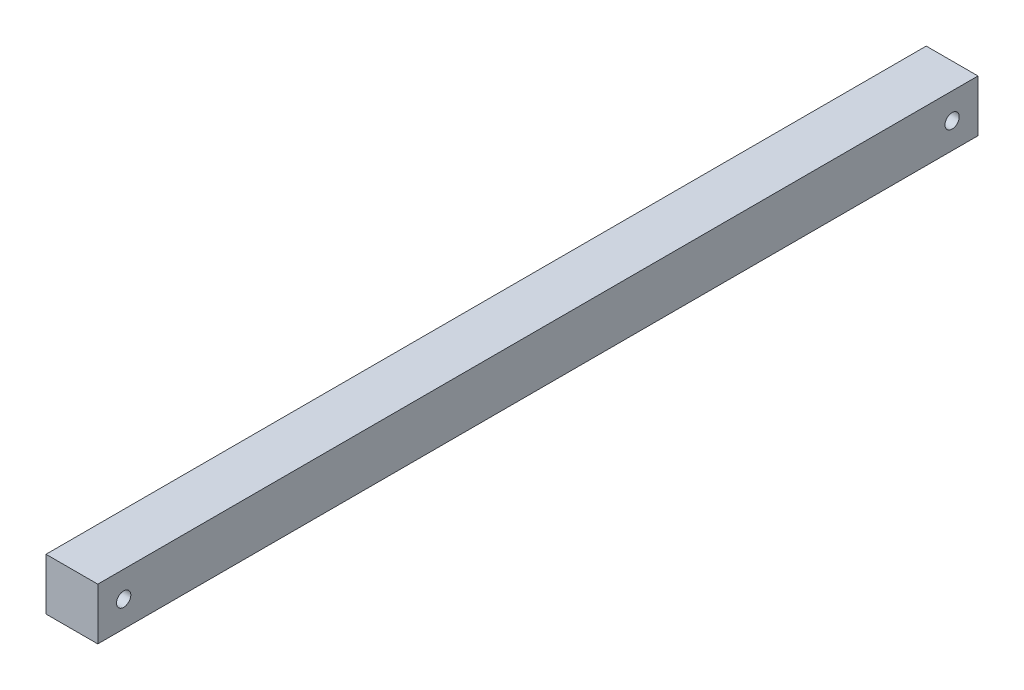
ISO-10303-21;
HEADER;
FILE_DESCRIPTION(('STEP AP214'),'2;1');
FILE_NAME('part.step','',(''),(''),'','','');
FILE_SCHEMA(('AUTOMOTIVE_DESIGN { 1 0 10303 214 1 1 1 1 }'));
ENDSEC;
DATA;
#1=APPLICATION_CONTEXT('core data for automotive mechanical design processes');
#2=APPLICATION_PROTOCOL_DEFINITION('international standard','automotive_design',2000,#1);
#3=PRODUCT_CONTEXT('',#1,'mechanical');
#4=PRODUCT('Part','Part','',(#3));
#5=PRODUCT_RELATED_PRODUCT_CATEGORY('part','',(#4));
#6=PRODUCT_DEFINITION_FORMATION('','',#4);
#7=PRODUCT_DEFINITION_CONTEXT('part definition',#1,'design');
#8=PRODUCT_DEFINITION('design','',#6,#7);
#9=PRODUCT_DEFINITION_SHAPE('','',#8);
#10=(LENGTH_UNIT() NAMED_UNIT(*) SI_UNIT(.MILLI.,.METRE.));
#11=(NAMED_UNIT(*) PLANE_ANGLE_UNIT() SI_UNIT($,.RADIAN.));
#12=(NAMED_UNIT(*) SI_UNIT($,.STERADIAN.) SOLID_ANGLE_UNIT());
#13=UNCERTAINTY_MEASURE_WITH_UNIT(LENGTH_MEASURE(1.E-05),#10,'distance_accuracy_value','');
#14=(GEOMETRIC_REPRESENTATION_CONTEXT(3) GLOBAL_UNCERTAINTY_ASSIGNED_CONTEXT((#13)) GLOBAL_UNIT_ASSIGNED_CONTEXT((#10,
#11,#12)) REPRESENTATION_CONTEXT('',''));
#15=CARTESIAN_POINT('',(0.,0.,0.));
#16=DIRECTION('',(0.,0.,1.));
#17=DIRECTION('',(1.,0.,0.));
#18=AXIS2_PLACEMENT_3D('',#15,#16,#17);
#19=CARTESIAN_POINT('',(12.7,-12.7,431.8));
#20=DIRECTION('',(-1.,0.,0.));
#21=DIRECTION('',(0.,0.,1.));
#22=AXIS2_PLACEMENT_3D('',#19,#20,#21);
#23=PLANE('',#22);
#24=CARTESIAN_POINT('',(12.7,0.,419.1));
#25=DIRECTION('',(-1.,0.,0.));
#26=DIRECTION('',(0.,0.,1.));
#27=AXIS2_PLACEMENT_3D('',#24,#25,#26);
#28=CIRCLE('',#27,3.50000000000002);
#29=CARTESIAN_POINT('',(12.7,0.,422.6));
#30=VERTEX_POINT('',#29);
#31=EDGE_CURVE('E101',#30,#30,#28,.T.);
#32=ORIENTED_EDGE('',*,*,#31,.T.);
#33=EDGE_LOOP('',(#32));
#34=FACE_BOUND('',#33,.T.);
#35=CARTESIAN_POINT('',(12.7,0.,12.7));
#36=DIRECTION('',(-1.,0.,0.));
#37=DIRECTION('',(0.,0.,-1.));
#38=AXIS2_PLACEMENT_3D('',#35,#36,#37);
#39=CIRCLE('',#38,3.50000000000003);
#40=CARTESIAN_POINT('',(12.7,0.,9.19999999999996));
#41=VERTEX_POINT('',#40);
#42=EDGE_CURVE('E115',#41,#41,#39,.T.);
#43=ORIENTED_EDGE('',*,*,#42,.T.);
#44=EDGE_LOOP('',(#43));
#45=FACE_BOUND('',#44,.T.);
#46=DIRECTION('',(0.,1.,0.));
#47=VECTOR('',#46,1.);
#48=CARTESIAN_POINT('',(12.7,-12.7,0.));
#49=LINE('',#48,#47);
#50=CARTESIAN_POINT('',(12.7,-12.7,0.));
#51=VERTEX_POINT('',#50);
#52=CARTESIAN_POINT('',(12.7,12.7,0.));
#53=VERTEX_POINT('',#52);
#54=EDGE_CURVE('E98',#51,#53,#49,.T.);
#55=ORIENTED_EDGE('',*,*,#54,.T.);
#56=DIRECTION('',(0.,0.,-1.));
#57=VECTOR('',#56,1.);
#58=CARTESIAN_POINT('',(12.7,12.7,431.8));
#59=LINE('',#58,#57);
#60=CARTESIAN_POINT('',(12.7,12.7,431.8));
#61=VERTEX_POINT('',#60);
#62=EDGE_CURVE('E11',#61,#53,#59,.T.);
#63=ORIENTED_EDGE('',*,*,#62,.F.);
#64=DIRECTION('',(0.,1.,0.));
#65=VECTOR('',#64,1.);
#66=CARTESIAN_POINT('',(12.7,-12.7,431.8));
#67=LINE('',#66,#65);
#68=CARTESIAN_POINT('',(12.7,-12.7,431.8));
#69=VERTEX_POINT('',#68);
#70=EDGE_CURVE('E86',#69,#61,#67,.T.);
#71=ORIENTED_EDGE('',*,*,#70,.F.);
#72=DIRECTION('',(0.,0.,-1.));
#73=VECTOR('',#72,1.);
#74=CARTESIAN_POINT('',(12.7,-12.7,431.8));
#75=LINE('',#74,#73);
#76=EDGE_CURVE('E94',#69,#51,#75,.T.);
#77=ORIENTED_EDGE('',*,*,#76,.T.);
#78=EDGE_LOOP('',(#55,#63,#71,#77));
#79=FACE_BOUND('',#78,.T.);
#80=ADVANCED_FACE('F35',(#34,#45,#79),#23,.F.);
#81=CARTESIAN_POINT('',(-12.7,12.7,431.8));
#82=DIRECTION('',(0.,-1.,0.));
#83=DIRECTION('',(0.,0.,-1.));
#84=AXIS2_PLACEMENT_3D('',#81,#82,#83);
#85=PLANE('',#84);
#86=DIRECTION('',(-1.,0.,0.));
#87=VECTOR('',#86,1.);
#88=CARTESIAN_POINT('',(-12.7,12.7,0.));
#89=LINE('',#88,#87);
#90=CARTESIAN_POINT('',(-12.7,12.7,0.));
#91=VERTEX_POINT('',#90);
#92=EDGE_CURVE('E90',#53,#91,#89,.T.);
#93=ORIENTED_EDGE('',*,*,#92,.T.);
#94=DIRECTION('',(0.,0.,-1.));
#95=VECTOR('',#94,1.);
#96=CARTESIAN_POINT('',(-12.7,12.7,431.8));
#97=LINE('',#96,#95);
#98=CARTESIAN_POINT('',(-12.7,12.7,431.8));
#99=VERTEX_POINT('',#98);
#100=EDGE_CURVE('E43',#99,#91,#97,.T.);
#101=ORIENTED_EDGE('',*,*,#100,.F.);
#102=DIRECTION('',(-1.,0.,0.));
#103=VECTOR('',#102,1.);
#104=CARTESIAN_POINT('',(-12.7,12.7,431.8));
#105=LINE('',#104,#103);
#106=EDGE_CURVE('E81',#61,#99,#105,.T.);
#107=ORIENTED_EDGE('',*,*,#106,.F.);
#108=ORIENTED_EDGE('',*,*,#62,.T.);
#109=EDGE_LOOP('',(#93,#101,#107,#108));
#110=FACE_BOUND('',#109,.T.);
#111=ADVANCED_FACE('F89',(#110),#85,.F.);
#112=CARTESIAN_POINT('',(-12.7,-12.7,431.8));
#113=DIRECTION('',(1.,0.,0.));
#114=DIRECTION('',(0.,0.,-1.));
#115=AXIS2_PLACEMENT_3D('',#112,#113,#114);
#116=PLANE('',#115);
#117=CARTESIAN_POINT('',(-12.7,0.,419.1));
#118=DIRECTION('',(-1.,0.,0.));
#119=DIRECTION('',(0.,0.,1.));
#120=AXIS2_PLACEMENT_3D('',#117,#118,#119);
#121=CIRCLE('',#120,3.50000000000002);
#122=CARTESIAN_POINT('',(-12.7,0.,422.6));
#123=VERTEX_POINT('',#122);
#124=EDGE_CURVE('E118',#123,#123,#121,.T.);
#125=ORIENTED_EDGE('',*,*,#124,.F.);
#126=EDGE_LOOP('',(#125));
#127=FACE_BOUND('',#126,.T.);
#128=CARTESIAN_POINT('',(-12.7,0.,12.7));
#129=DIRECTION('',(-1.,0.,0.));
#130=DIRECTION('',(0.,0.,-1.));
#131=AXIS2_PLACEMENT_3D('',#128,#129,#130);
#132=CIRCLE('',#131,3.50000000000003);
#133=CARTESIAN_POINT('',(-12.7,0.,9.19999999999996));
#134=VERTEX_POINT('',#133);
#135=EDGE_CURVE('E112',#134,#134,#132,.T.);
#136=ORIENTED_EDGE('',*,*,#135,.F.);
#137=EDGE_LOOP('',(#136));
#138=FACE_BOUND('',#137,.T.);
#139=DIRECTION('',(0.,-1.,0.));
#140=VECTOR('',#139,1.);
#141=CARTESIAN_POINT('',(-12.7,-12.7,0.));
#142=LINE('',#141,#140);
#143=CARTESIAN_POINT('',(-12.7,-12.7,0.));
#144=VERTEX_POINT('',#143);
#145=EDGE_CURVE('E68',#91,#144,#142,.T.);
#146=ORIENTED_EDGE('',*,*,#145,.T.);
#147=DIRECTION('',(0.,0.,-1.));
#148=VECTOR('',#147,1.);
#149=CARTESIAN_POINT('',(-12.7,-12.7,431.8));
#150=LINE('',#149,#148);
#151=CARTESIAN_POINT('',(-12.7,-12.7,431.8));
#152=VERTEX_POINT('',#151);
#153=EDGE_CURVE('E91',#152,#144,#150,.T.);
#154=ORIENTED_EDGE('',*,*,#153,.F.);
#155=DIRECTION('',(0.,-1.,0.));
#156=VECTOR('',#155,1.);
#157=CARTESIAN_POINT('',(-12.7,-12.7,431.8));
#158=LINE('',#157,#156);
#159=EDGE_CURVE('E84',#99,#152,#158,.T.);
#160=ORIENTED_EDGE('',*,*,#159,.F.);
#161=ORIENTED_EDGE('',*,*,#100,.T.);
#162=EDGE_LOOP('',(#146,#154,#160,#161));
#163=FACE_BOUND('',#162,.T.);
#164=ADVANCED_FACE('F92',(#127,#138,#163),#116,.F.);
#165=CARTESIAN_POINT('',(-12.7,-12.7,431.8));
#166=DIRECTION('',(0.,1.,0.));
#167=DIRECTION('',(0.,0.,1.));
#168=AXIS2_PLACEMENT_3D('',#165,#166,#167);
#169=PLANE('',#168);
#170=DIRECTION('',(1.,0.,0.));
#171=VECTOR('',#170,1.);
#172=CARTESIAN_POINT('',(-12.7,-12.7,0.));
#173=LINE('',#172,#171);
#174=EDGE_CURVE('E74',#144,#51,#173,.T.);
#175=ORIENTED_EDGE('',*,*,#174,.T.);
#176=ORIENTED_EDGE('',*,*,#76,.F.);
#177=DIRECTION('',(1.,0.,0.));
#178=VECTOR('',#177,1.);
#179=CARTESIAN_POINT('',(-12.7,-12.7,431.8));
#180=LINE('',#179,#178);
#181=EDGE_CURVE('E51',#152,#69,#180,.T.);
#182=ORIENTED_EDGE('',*,*,#181,.F.);
#183=ORIENTED_EDGE('',*,*,#153,.T.);
#184=EDGE_LOOP('',(#175,#176,#182,#183));
#185=FACE_BOUND('',#184,.T.);
#186=ADVANCED_FACE('F106',(#185),#169,.F.);
#187=CARTESIAN_POINT('',(0.,0.,431.8));
#188=DIRECTION('',(0.,0.,-1.));
#189=DIRECTION('',(-1.,0.,0.));
#190=AXIS2_PLACEMENT_3D('',#187,#188,#189);
#191=PLANE('',#190);
#192=ORIENTED_EDGE('',*,*,#70,.T.);
#193=ORIENTED_EDGE('',*,*,#106,.T.);
#194=ORIENTED_EDGE('',*,*,#159,.T.);
#195=ORIENTED_EDGE('',*,*,#181,.T.);
#196=EDGE_LOOP('',(#192,#193,#194,#195));
#197=FACE_BOUND('',#196,.T.);
#198=ADVANCED_FACE('F82',(#197),#191,.F.);
#199=CARTESIAN_POINT('',(0.,0.,0.));
#200=DIRECTION('',(0.,0.,-1.));
#201=DIRECTION('',(-1.,0.,0.));
#202=AXIS2_PLACEMENT_3D('',#199,#200,#201);
#203=PLANE('',#202);
#204=ORIENTED_EDGE('',*,*,#54,.F.);
#205=ORIENTED_EDGE('',*,*,#174,.F.);
#206=ORIENTED_EDGE('',*,*,#145,.F.);
#207=ORIENTED_EDGE('',*,*,#92,.F.);
#208=EDGE_LOOP('',(#204,#205,#206,#207));
#209=FACE_BOUND('',#208,.T.);
#210=ADVANCED_FACE('F109',(#209),#203,.T.);
#211=CARTESIAN_POINT('',(12.7,0.,12.7));
#212=DIRECTION('',(-1.,0.,0.));
#213=DIRECTION('',(0.,0.,1.));
#214=AXIS2_PLACEMENT_3D('',#211,#212,#213);
#215=CYLINDRICAL_SURFACE('',#214,3.50000000000003);
#216=ORIENTED_EDGE('',*,*,#42,.F.);
#217=EDGE_LOOP('',(#216));
#218=FACE_BOUND('',#217,.T.);
#219=ORIENTED_EDGE('',*,*,#135,.T.);
#220=EDGE_LOOP('',(#219));
#221=FACE_BOUND('',#220,.T.);
#222=ADVANCED_FACE('F129',(#218,#221),#215,.F.);
#223=CARTESIAN_POINT('',(12.7,0.,419.1));
#224=DIRECTION('',(-1.,0.,0.));
#225=DIRECTION('',(0.,0.,1.));
#226=AXIS2_PLACEMENT_3D('',#223,#224,#225);
#227=CYLINDRICAL_SURFACE('',#226,3.50000000000002);
#228=ORIENTED_EDGE('',*,*,#31,.F.);
#229=EDGE_LOOP('',(#228));
#230=FACE_BOUND('',#229,.T.);
#231=ORIENTED_EDGE('',*,*,#124,.T.);
#232=EDGE_LOOP('',(#231));
#233=FACE_BOUND('',#232,.T.);
#234=ADVANCED_FACE('F126',(#230,#233),#227,.F.);
#235=CLOSED_SHELL('',(#80,#111,#164,#186,#198,#210,#222,#234));
#236=MANIFOLD_SOLID_BREP('B2',#235);
#237=ADVANCED_BREP_SHAPE_REPRESENTATION('',(#18,#236),#14);
#238=SHAPE_DEFINITION_REPRESENTATION(#9,#237);
ENDSEC;
END-ISO-10303-21;
